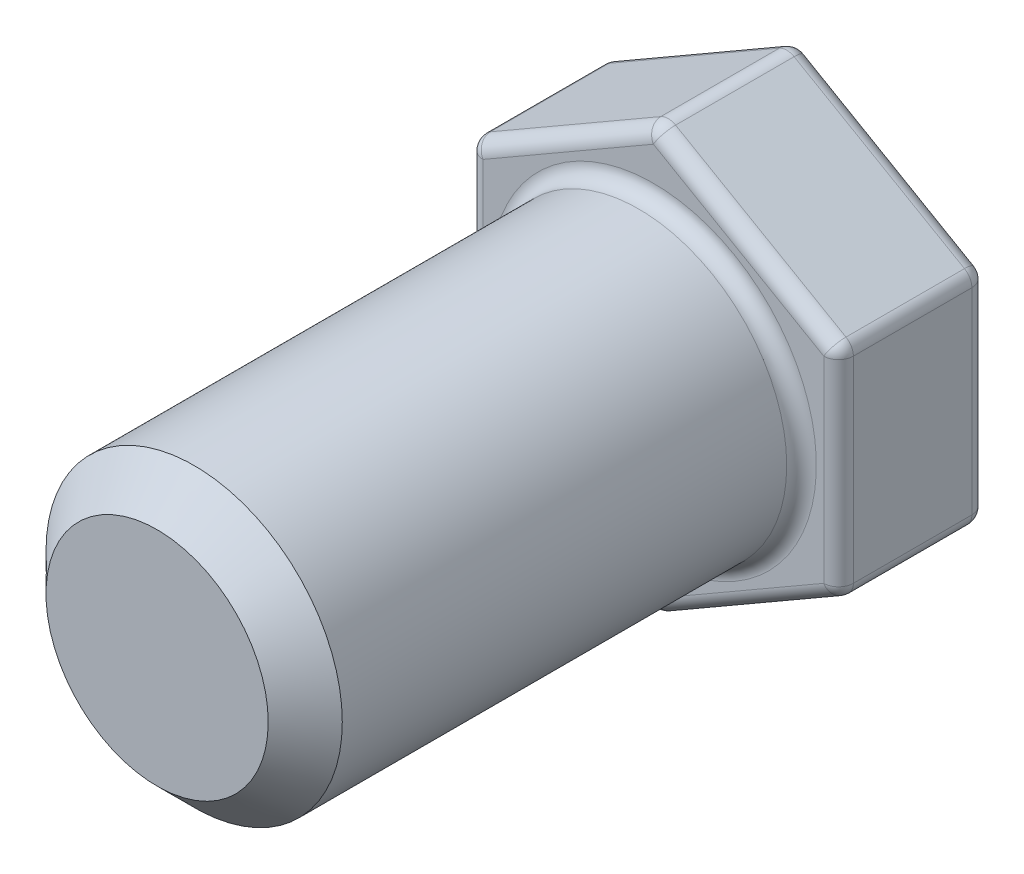
ISO-10303-21;
HEADER;
FILE_DESCRIPTION(('STEP AP214'),'2;1');
FILE_NAME('part.step','',(''),(''),'','','');
FILE_SCHEMA(('AUTOMOTIVE_DESIGN { 1 0 10303 214 1 1 1 1 }'));
ENDSEC;
DATA;
#1=APPLICATION_CONTEXT('core data for automotive mechanical design processes');
#2=APPLICATION_PROTOCOL_DEFINITION('international standard','automotive_design',2000,#1);
#3=PRODUCT_CONTEXT('',#1,'mechanical');
#4=PRODUCT('Part','Part','',(#3));
#5=PRODUCT_RELATED_PRODUCT_CATEGORY('part','',(#4));
#6=PRODUCT_DEFINITION_FORMATION('','',#4);
#7=PRODUCT_DEFINITION_CONTEXT('part definition',#1,'design');
#8=PRODUCT_DEFINITION('design','',#6,#7);
#9=PRODUCT_DEFINITION_SHAPE('','',#8);
#10=(LENGTH_UNIT() NAMED_UNIT(*) SI_UNIT(.MILLI.,.METRE.));
#11=(NAMED_UNIT(*) PLANE_ANGLE_UNIT() SI_UNIT($,.RADIAN.));
#12=(NAMED_UNIT(*) SI_UNIT($,.STERADIAN.) SOLID_ANGLE_UNIT());
#13=UNCERTAINTY_MEASURE_WITH_UNIT(LENGTH_MEASURE(1.E-05),#10,'distance_accuracy_value','');
#14=(GEOMETRIC_REPRESENTATION_CONTEXT(3) GLOBAL_UNCERTAINTY_ASSIGNED_CONTEXT((#13)) GLOBAL_UNIT_ASSIGNED_CONTEXT((#10,
#11,#12)) REPRESENTATION_CONTEXT('',''));
#15=CARTESIAN_POINT('',(0.,0.,0.));
#16=DIRECTION('',(0.,0.,1.));
#17=DIRECTION('',(1.,0.,0.));
#18=AXIS2_PLACEMENT_3D('',#15,#16,#17);
#19=CARTESIAN_POINT('',(0.,0.,6.7));
#20=DIRECTION('',(0.,0.,-1.));
#21=DIRECTION('',(-1.,0.,0.));
#22=AXIS2_PLACEMENT_3D('',#19,#20,#21);
#23=CYLINDRICAL_SURFACE('',#22,2.);
#24=CARTESIAN_POINT('',(0.,0.,6.2));
#25=DIRECTION('',(0.,0.,1.));
#26=DIRECTION('',(1.,0.,0.));
#27=AXIS2_PLACEMENT_3D('',#24,#25,#26);
#28=CIRCLE('',#27,2.);
#29=CARTESIAN_POINT('',(2.,0.,6.2));
#30=VERTEX_POINT('',#29);
#31=EDGE_CURVE('E11',#30,#30,#28,.F.);
#32=ORIENTED_EDGE('',*,*,#31,.T.);
#33=EDGE_LOOP('',(#32));
#34=FACE_BOUND('',#33,.T.);
#35=CARTESIAN_POINT('',(0.,0.,0.2));
#36=DIRECTION('',(0.,0.,-1.));
#37=DIRECTION('',(-1.,0.,0.));
#38=AXIS2_PLACEMENT_3D('',#35,#36,#37);
#39=CIRCLE('',#38,2.);
#40=CARTESIAN_POINT('',(-2.,0.,0.2));
#41=VERTEX_POINT('',#40);
#42=EDGE_CURVE('E265',#41,#41,#39,.F.);
#43=ORIENTED_EDGE('',*,*,#42,.T.);
#44=EDGE_LOOP('',(#43));
#45=FACE_BOUND('',#44,.T.);
#46=ADVANCED_FACE('F40',(#34,#45),#23,.T.);
#47=CARTESIAN_POINT('',(0.,0.,6.7));
#48=DIRECTION('',(0.,0.,1.));
#49=DIRECTION('',(1.,0.,0.));
#50=AXIS2_PLACEMENT_3D('',#47,#48,#49);
#51=PLANE('',#50);
#52=CARTESIAN_POINT('',(0.,0.,6.7));
#53=DIRECTION('',(0.,0.,1.));
#54=DIRECTION('',(1.,0.,0.));
#55=AXIS2_PLACEMENT_3D('',#52,#53,#54);
#56=CIRCLE('',#55,1.5);
#57=CARTESIAN_POINT('',(1.5,0.,6.7));
#58=VERTEX_POINT('',#57);
#59=EDGE_CURVE('E48',#58,#58,#56,.T.);
#60=ORIENTED_EDGE('',*,*,#59,.T.);
#61=EDGE_LOOP('',(#60));
#62=FACE_BOUND('',#61,.T.);
#63=ADVANCED_FACE('F366',(#62),#51,.T.);
#64=CARTESIAN_POINT('',(0.,2.88675134594813,-2.));
#65=DIRECTION('',(-0.500000000000001,-0.866025403784438,0.));
#66=DIRECTION('',(0.866025403784438,-0.500000000000001,0.));
#67=AXIS2_PLACEMENT_3D('',#64,#65,#66);
#68=PLANE('',#67);
#69=DIRECTION('',(0.866025403784438,-0.500000000000001,0.));
#70=VECTOR('',#69,1.);
#71=CARTESIAN_POINT('',(0.,2.88675134594813,-1.8));
#72=LINE('',#71,#70);
#73=CARTESIAN_POINT('',(2.4,1.50111069989303,-1.8));
#74=VERTEX_POINT('',#73);
#75=CARTESIAN_POINT('',(0.100000000000001,2.82901631902917,-1.8));
#76=VERTEX_POINT('',#75);
#77=EDGE_CURVE('E242',#74,#76,#72,.F.);
#78=ORIENTED_EDGE('',*,*,#77,.T.);
#79=DIRECTION('',(0.,0.,1.));
#80=VECTOR('',#79,1.);
#81=CARTESIAN_POINT('',(0.100000000000001,2.82901631902917,-2.));
#82=LINE('',#81,#80);
#83=CARTESIAN_POINT('',(0.100000000000001,2.82901631902917,-0.2));
#84=VERTEX_POINT('',#83);
#85=EDGE_CURVE('E313',#76,#84,#82,.T.);
#86=ORIENTED_EDGE('',*,*,#85,.T.);
#87=DIRECTION('',(0.866025403784438,-0.500000000000001,0.));
#88=VECTOR('',#87,1.);
#89=CARTESIAN_POINT('',(0.,2.88675134594813,-0.2));
#90=LINE('',#89,#88);
#91=CARTESIAN_POINT('',(2.4,1.50111069989303,-0.2));
#92=VERTEX_POINT('',#91);
#93=EDGE_CURVE('E239',#84,#92,#90,.T.);
#94=ORIENTED_EDGE('',*,*,#93,.T.);
#95=DIRECTION('',(0.,0.,1.));
#96=VECTOR('',#95,1.);
#97=CARTESIAN_POINT('',(2.4,1.50111069989303,-2.));
#98=LINE('',#97,#96);
#99=EDGE_CURVE('E311',#92,#74,#98,.F.);
#100=ORIENTED_EDGE('',*,*,#99,.T.);
#101=EDGE_LOOP('',(#78,#86,#94,#100));
#102=FACE_BOUND('',#101,.T.);
#103=ADVANCED_FACE('F384',(#102),#68,.F.);
#104=CARTESIAN_POINT('',(2.5,1.44337567297406,-2.));
#105=DIRECTION('',(-1.,0.,0.));
#106=DIRECTION('',(0.,0.,1.));
#107=AXIS2_PLACEMENT_3D('',#104,#105,#106);
#108=PLANE('',#107);
#109=DIRECTION('',(0.,-1.,0.));
#110=VECTOR('',#109,1.);
#111=CARTESIAN_POINT('',(2.5,1.44337567297406,-0.2));
#112=LINE('',#111,#110);
#113=CARTESIAN_POINT('',(2.5,1.32790561913614,-0.2));
#114=VERTEX_POINT('',#113);
#115=CARTESIAN_POINT('',(2.5,-1.32790561913614,-0.2));
#116=VERTEX_POINT('',#115);
#117=EDGE_CURVE('E235',#114,#116,#112,.T.);
#118=ORIENTED_EDGE('',*,*,#117,.T.);
#119=DIRECTION('',(0.,0.,1.));
#120=VECTOR('',#119,1.);
#121=CARTESIAN_POINT('',(2.5,-1.32790561913614,-2.));
#122=LINE('',#121,#120);
#123=CARTESIAN_POINT('',(2.5,-1.32790561913614,-1.8));
#124=VERTEX_POINT('',#123);
#125=EDGE_CURVE('E332',#116,#124,#122,.F.);
#126=ORIENTED_EDGE('',*,*,#125,.T.);
#127=DIRECTION('',(0.,-1.,0.));
#128=VECTOR('',#127,1.);
#129=CARTESIAN_POINT('',(2.5,1.44337567297406,-1.8));
#130=LINE('',#129,#128);
#131=CARTESIAN_POINT('',(2.5,1.32790561913614,-1.8));
#132=VERTEX_POINT('',#131);
#133=EDGE_CURVE('E237',#124,#132,#130,.F.);
#134=ORIENTED_EDGE('',*,*,#133,.T.);
#135=DIRECTION('',(0.,0.,1.));
#136=VECTOR('',#135,1.);
#137=CARTESIAN_POINT('',(2.5,1.32790561913614,-2.));
#138=LINE('',#137,#136);
#139=EDGE_CURVE('E62',#132,#114,#138,.T.);
#140=ORIENTED_EDGE('',*,*,#139,.T.);
#141=EDGE_LOOP('',(#118,#126,#134,#140));
#142=FACE_BOUND('',#141,.T.);
#143=ADVANCED_FACE('F550',(#142),#108,.F.);
#144=CARTESIAN_POINT('',(2.5,-1.44337567297406,-2.));
#145=DIRECTION('',(-0.5,0.866025403784439,0.));
#146=DIRECTION('',(-0.866025403784439,-0.5,0.));
#147=AXIS2_PLACEMENT_3D('',#144,#145,#146);
#148=PLANE('',#147);
#149=DIRECTION('',(-0.866025403784439,-0.5,0.));
#150=VECTOR('',#149,1.);
#151=CARTESIAN_POINT('',(2.5,-1.44337567297406,-0.2));
#152=LINE('',#151,#150);
#153=CARTESIAN_POINT('',(2.4,-1.50111069989303,-0.2));
#154=VERTEX_POINT('',#153);
#155=CARTESIAN_POINT('',(0.099999999999999,-2.82901631902917,-0.2));
#156=VERTEX_POINT('',#155);
#157=EDGE_CURVE('E229',#154,#156,#152,.T.);
#158=ORIENTED_EDGE('',*,*,#157,.T.);
#159=DIRECTION('',(0.,0.,1.));
#160=VECTOR('',#159,1.);
#161=CARTESIAN_POINT('',(0.1,-2.82901631902917,-2.));
#162=LINE('',#161,#160);
#163=CARTESIAN_POINT('',(0.099999999999999,-2.82901631902917,-1.8));
#164=VERTEX_POINT('',#163);
#165=EDGE_CURVE('E329',#156,#164,#162,.F.);
#166=ORIENTED_EDGE('',*,*,#165,.T.);
#167=DIRECTION('',(-0.866025403784439,-0.5,0.));
#168=VECTOR('',#167,1.);
#169=CARTESIAN_POINT('',(2.5,-1.44337567297406,-1.8));
#170=LINE('',#169,#168);
#171=CARTESIAN_POINT('',(2.4,-1.50111069989303,-1.8));
#172=VERTEX_POINT('',#171);
#173=EDGE_CURVE('E232',#164,#172,#170,.F.);
#174=ORIENTED_EDGE('',*,*,#173,.T.);
#175=DIRECTION('',(0.,0.,1.));
#176=VECTOR('',#175,1.);
#177=CARTESIAN_POINT('',(2.4,-1.50111069989303,-2.));
#178=LINE('',#177,#176);
#179=EDGE_CURVE('E327',#172,#154,#178,.T.);
#180=ORIENTED_EDGE('',*,*,#179,.T.);
#181=EDGE_LOOP('',(#158,#166,#174,#180));
#182=FACE_BOUND('',#181,.T.);
#183=ADVANCED_FACE('F546',(#182),#148,.F.);
#184=CARTESIAN_POINT('',(0.,-2.88675134594813,-2.));
#185=DIRECTION('',(0.5,0.866025403784438,0.));
#186=DIRECTION('',(-0.866025403784438,0.5,0.));
#187=AXIS2_PLACEMENT_3D('',#184,#185,#186);
#188=PLANE('',#187);
#189=DIRECTION('',(-0.866025403784438,0.5,0.));
#190=VECTOR('',#189,1.);
#191=CARTESIAN_POINT('',(0.,-2.88675134594813,-0.2));
#192=LINE('',#191,#190);
#193=CARTESIAN_POINT('',(-0.0999999999999999,-2.82901631902917,-0.2));
#194=VERTEX_POINT('',#193);
#195=CARTESIAN_POINT('',(-2.4,-1.50111069989303,-0.2));
#196=VERTEX_POINT('',#195);
#197=EDGE_CURVE('E223',#194,#196,#192,.T.);
#198=ORIENTED_EDGE('',*,*,#197,.T.);
#199=DIRECTION('',(0.,0.,1.));
#200=VECTOR('',#199,1.);
#201=CARTESIAN_POINT('',(-2.4,-1.50111069989303,-2.));
#202=LINE('',#201,#200);
#203=CARTESIAN_POINT('',(-2.4,-1.50111069989303,-1.8));
#204=VERTEX_POINT('',#203);
#205=EDGE_CURVE('E325',#196,#204,#202,.F.);
#206=ORIENTED_EDGE('',*,*,#205,.T.);
#207=DIRECTION('',(-0.866025403784438,0.5,0.));
#208=VECTOR('',#207,1.);
#209=CARTESIAN_POINT('',(0.,-2.88675134594813,-1.8));
#210=LINE('',#209,#208);
#211=CARTESIAN_POINT('',(-0.0999999999999998,-2.82901631902917,-1.8));
#212=VERTEX_POINT('',#211);
#213=EDGE_CURVE('E226',#204,#212,#210,.F.);
#214=ORIENTED_EDGE('',*,*,#213,.T.);
#215=DIRECTION('',(0.,0.,1.));
#216=VECTOR('',#215,1.);
#217=CARTESIAN_POINT('',(-0.0999999999999999,-2.82901631902917,-2.));
#218=LINE('',#217,#216);
#219=EDGE_CURVE('E323',#212,#194,#218,.T.);
#220=ORIENTED_EDGE('',*,*,#219,.T.);
#221=EDGE_LOOP('',(#198,#206,#214,#220));
#222=FACE_BOUND('',#221,.T.);
#223=ADVANCED_FACE('F540',(#222),#188,.F.);
#224=CARTESIAN_POINT('',(-2.5,-1.44337567297406,-2.));
#225=DIRECTION('',(1.,0.,0.));
#226=DIRECTION('',(0.,1.,0.));
#227=AXIS2_PLACEMENT_3D('',#224,#225,#226);
#228=PLANE('',#227);
#229=DIRECTION('',(0.,1.,0.));
#230=VECTOR('',#229,1.);
#231=CARTESIAN_POINT('',(-2.5,-1.44337567297406,-0.2));
#232=LINE('',#231,#230);
#233=CARTESIAN_POINT('',(-2.5,-1.32790561913614,-0.2));
#234=VERTEX_POINT('',#233);
#235=CARTESIAN_POINT('',(-2.5,1.32790561913614,-0.2));
#236=VERTEX_POINT('',#235);
#237=EDGE_CURVE('E217',#234,#236,#232,.T.);
#238=ORIENTED_EDGE('',*,*,#237,.T.);
#239=DIRECTION('',(0.,0.,1.));
#240=VECTOR('',#239,1.);
#241=CARTESIAN_POINT('',(-2.5,1.32790561913614,-2.));
#242=LINE('',#241,#240);
#243=CARTESIAN_POINT('',(-2.5,1.32790561913614,-1.8));
#244=VERTEX_POINT('',#243);
#245=EDGE_CURVE('E321',#236,#244,#242,.F.);
#246=ORIENTED_EDGE('',*,*,#245,.T.);
#247=DIRECTION('',(0.,1.,0.));
#248=VECTOR('',#247,1.);
#249=CARTESIAN_POINT('',(-2.5,-1.44337567297406,-1.8));
#250=LINE('',#249,#248);
#251=CARTESIAN_POINT('',(-2.5,-1.32790561913614,-1.8));
#252=VERTEX_POINT('',#251);
#253=EDGE_CURVE('E220',#244,#252,#250,.F.);
#254=ORIENTED_EDGE('',*,*,#253,.T.);
#255=DIRECTION('',(0.,0.,1.));
#256=VECTOR('',#255,1.);
#257=CARTESIAN_POINT('',(-2.5,-1.32790561913614,-2.));
#258=LINE('',#257,#256);
#259=EDGE_CURVE('E319',#252,#234,#258,.T.);
#260=ORIENTED_EDGE('',*,*,#259,.T.);
#261=EDGE_LOOP('',(#238,#246,#254,#260));
#262=FACE_BOUND('',#261,.T.);
#263=ADVANCED_FACE('F527',(#262),#228,.F.);
#264=CARTESIAN_POINT('',(-2.5,1.44337567297407,-2.));
#265=DIRECTION('',(0.5,-0.866025403784439,0.));
#266=DIRECTION('',(0.866025403784439,0.5,0.));
#267=AXIS2_PLACEMENT_3D('',#264,#265,#266);
#268=PLANE('',#267);
#269=DIRECTION('',(0.866025403784439,0.5,0.));
#270=VECTOR('',#269,1.);
#271=CARTESIAN_POINT('',(-2.5,1.44337567297407,-0.2));
#272=LINE('',#271,#270);
#273=CARTESIAN_POINT('',(-2.4,1.50111069989303,-0.2));
#274=VERTEX_POINT('',#273);
#275=CARTESIAN_POINT('',(-0.099999999999999,2.82901631902917,-0.2));
#276=VERTEX_POINT('',#275);
#277=EDGE_CURVE('E208',#274,#276,#272,.T.);
#278=ORIENTED_EDGE('',*,*,#277,.T.);
#279=DIRECTION('',(0.,0.,1.));
#280=VECTOR('',#279,1.);
#281=CARTESIAN_POINT('',(-0.0999999999999994,2.82901631902917,-2.));
#282=LINE('',#281,#280);
#283=CARTESIAN_POINT('',(-0.0999999999999985,2.82901631902917,-1.8));
#284=VERTEX_POINT('',#283);
#285=EDGE_CURVE('E317',#276,#284,#282,.F.);
#286=ORIENTED_EDGE('',*,*,#285,.T.);
#287=DIRECTION('',(0.866025403784439,0.5,0.));
#288=VECTOR('',#287,1.);
#289=CARTESIAN_POINT('',(-2.5,1.44337567297407,-1.8));
#290=LINE('',#289,#288);
#291=CARTESIAN_POINT('',(-2.4,1.50111069989303,-1.8));
#292=VERTEX_POINT('',#291);
#293=EDGE_CURVE('E189',#284,#292,#290,.F.);
#294=ORIENTED_EDGE('',*,*,#293,.T.);
#295=DIRECTION('',(0.,0.,1.));
#296=VECTOR('',#295,1.);
#297=CARTESIAN_POINT('',(-2.4,1.50111069989303,-2.));
#298=LINE('',#297,#296);
#299=EDGE_CURVE('E315',#292,#274,#298,.T.);
#300=ORIENTED_EDGE('',*,*,#299,.T.);
#301=EDGE_LOOP('',(#278,#286,#294,#300));
#302=FACE_BOUND('',#301,.T.);
#303=ADVANCED_FACE('F532',(#302),#268,.F.);
#304=CARTESIAN_POINT('',(0.,0.,-2.));
#305=DIRECTION('',(0.,0.,-1.));
#306=DIRECTION('',(-1.,0.,0.));
#307=AXIS2_PLACEMENT_3D('',#304,#305,#306);
#308=PLANE('',#307);
#309=DIRECTION('',(0.,1.,0.));
#310=VECTOR('',#309,1.);
#311=CARTESIAN_POINT('',(-2.3,1.44337567297407,-2.));
#312=LINE('',#311,#310);
#313=CARTESIAN_POINT('',(-2.3,-1.32790561913614,-2.));
#314=VERTEX_POINT('',#313);
#315=CARTESIAN_POINT('',(-2.3,1.32790561913614,-2.));
#316=VERTEX_POINT('',#315);
#317=EDGE_CURVE('E207',#314,#316,#312,.T.);
#318=ORIENTED_EDGE('',*,*,#317,.T.);
#319=DIRECTION('',(0.866025403784439,0.5,0.));
#320=VECTOR('',#319,1.);
#321=CARTESIAN_POINT('',(0.100000000000001,2.71354626519124,-2.));
#322=LINE('',#321,#320);
#323=CARTESIAN_POINT('',(0.,2.65581123827228,-2.));
#324=VERTEX_POINT('',#323);
#325=EDGE_CURVE('E186',#316,#324,#322,.T.);
#326=ORIENTED_EDGE('',*,*,#325,.T.);
#327=DIRECTION('',(0.866025403784438,-0.500000000000001,0.));
#328=VECTOR('',#327,1.);
#329=CARTESIAN_POINT('',(2.4,1.27017059221718,-2.));
#330=LINE('',#329,#328);
#331=CARTESIAN_POINT('',(2.3,1.32790561913614,-2.));
#332=VERTEX_POINT('',#331);
#333=EDGE_CURVE('E194',#324,#332,#330,.T.);
#334=ORIENTED_EDGE('',*,*,#333,.T.);
#335=DIRECTION('',(0.,-1.,0.));
#336=VECTOR('',#335,1.);
#337=CARTESIAN_POINT('',(2.3,-1.44337567297406,-2.));
#338=LINE('',#337,#336);
#339=CARTESIAN_POINT('',(2.3,-1.32790561913614,-2.));
#340=VERTEX_POINT('',#339);
#341=EDGE_CURVE('E200',#332,#340,#338,.T.);
#342=ORIENTED_EDGE('',*,*,#341,.T.);
#343=DIRECTION('',(-0.866025403784439,-0.5,0.));
#344=VECTOR('',#343,1.);
#345=CARTESIAN_POINT('',(-0.1,-2.71354626519124,-2.));
#346=LINE('',#345,#344);
#347=CARTESIAN_POINT('',(0.,-2.65581123827228,-2.));
#348=VERTEX_POINT('',#347);
#349=EDGE_CURVE('E832',#340,#348,#346,.T.);
#350=ORIENTED_EDGE('',*,*,#349,.T.);
#351=DIRECTION('',(-0.866025403784438,0.5,0.));
#352=VECTOR('',#351,1.);
#353=CARTESIAN_POINT('',(-2.4,-1.27017059221718,-2.));
#354=LINE('',#353,#352);
#355=EDGE_CURVE('E212',#348,#314,#354,.T.);
#356=ORIENTED_EDGE('',*,*,#355,.T.);
#357=EDGE_LOOP('',(#318,#326,#334,#342,#350,#356));
#358=FACE_BOUND('',#357,.T.);
#359=ADVANCED_FACE('F204',(#358),#308,.T.);
#360=CARTESIAN_POINT('',(0.,0.,0.));
#361=DIRECTION('',(0.,0.,-1.));
#362=DIRECTION('',(-1.,0.,0.));
#363=AXIS2_PLACEMENT_3D('',#360,#361,#362);
#364=PLANE('',#363);
#365=DIRECTION('',(-0.866025403784439,-0.5,0.));
#366=VECTOR('',#365,1.);
#367=CARTESIAN_POINT('',(1.15,-1.99185842870421,0.));
#368=LINE('',#367,#366);
#369=CARTESIAN_POINT('',(0.,-2.65581123827228,0.));
#370=VERTEX_POINT('',#369);
#371=CARTESIAN_POINT('',(2.3,-1.32790561913614,0.));
#372=VERTEX_POINT('',#371);
#373=EDGE_CURVE('E259',#370,#372,#368,.F.);
#374=ORIENTED_EDGE('',*,*,#373,.T.);
#375=DIRECTION('',(0.,-1.,0.));
#376=VECTOR('',#375,1.);
#377=CARTESIAN_POINT('',(2.3,0.,0.));
#378=LINE('',#377,#376);
#379=CARTESIAN_POINT('',(2.3,1.32790561913614,0.));
#380=VERTEX_POINT('',#379);
#381=EDGE_CURVE('E262',#372,#380,#378,.F.);
#382=ORIENTED_EDGE('',*,*,#381,.T.);
#383=DIRECTION('',(0.866025403784438,-0.500000000000001,0.));
#384=VECTOR('',#383,1.);
#385=CARTESIAN_POINT('',(1.15,1.99185842870421,0.));
#386=LINE('',#385,#384);
#387=CARTESIAN_POINT('',(0.,2.65581123827228,0.));
#388=VERTEX_POINT('',#387);
#389=EDGE_CURVE('E247',#380,#388,#386,.F.);
#390=ORIENTED_EDGE('',*,*,#389,.T.);
#391=DIRECTION('',(0.866025403784439,0.5,0.));
#392=VECTOR('',#391,1.);
#393=CARTESIAN_POINT('',(-1.15,1.99185842870421,0.));
#394=LINE('',#393,#392);
#395=CARTESIAN_POINT('',(-2.3,1.32790561913614,0.));
#396=VERTEX_POINT('',#395);
#397=EDGE_CURVE('E250',#388,#396,#394,.F.);
#398=ORIENTED_EDGE('',*,*,#397,.T.);
#399=DIRECTION('',(0.,1.,0.));
#400=VECTOR('',#399,1.);
#401=CARTESIAN_POINT('',(-2.3,0.,0.));
#402=LINE('',#401,#400);
#403=CARTESIAN_POINT('',(-2.3,-1.32790561913614,0.));
#404=VERTEX_POINT('',#403);
#405=EDGE_CURVE('E253',#396,#404,#402,.F.);
#406=ORIENTED_EDGE('',*,*,#405,.T.);
#407=DIRECTION('',(-0.866025403784438,0.5,0.));
#408=VECTOR('',#407,1.);
#409=CARTESIAN_POINT('',(-1.15,-1.99185842870421,0.));
#410=LINE('',#409,#408);
#411=EDGE_CURVE('E256',#404,#370,#410,.F.);
#412=ORIENTED_EDGE('',*,*,#411,.T.);
#413=EDGE_LOOP('',(#374,#382,#390,#398,#406,#412));
#414=FACE_BOUND('',#413,.T.);
#415=CARTESIAN_POINT('',(0.,0.,0.));
#416=DIRECTION('',(0.,0.,-1.));
#417=DIRECTION('',(-1.,0.,0.));
#418=AXIS2_PLACEMENT_3D('',#415,#416,#417);
#419=CIRCLE('',#418,2.2);
#420=CARTESIAN_POINT('',(-2.2,0.,0.));
#421=VERTEX_POINT('',#420);
#422=EDGE_CURVE('E244',#421,#421,#419,.T.);
#423=ORIENTED_EDGE('',*,*,#422,.T.);
#424=EDGE_LOOP('',(#423));
#425=FACE_BOUND('',#424,.T.);
#426=ADVANCED_FACE('F409',(#414,#425),#364,.F.);
#427=CARTESIAN_POINT('',(1.15,-1.99185842870421,-1.8));
#428=DIRECTION('',(0.866025403784439,0.5,0.));
#429=DIRECTION('',(-0.5,0.866025403784439,0.));
#430=AXIS2_PLACEMENT_3D('',#427,#428,#429);
#431=CYLINDRICAL_SURFACE('',#430,0.2);
#432=ORIENTED_EDGE('',*,*,#173,.F.);
#433=CARTESIAN_POINT('',(0.,-2.65581123827228,-1.8));
#434=DIRECTION('',(0.866025403784439,0.5,0.));
#435=DIRECTION('',(-0.5,0.866025403784439,0.));
#436=AXIS2_PLACEMENT_3D('',#433,#434,#435);
#437=CIRCLE('',#436,0.2);
#438=EDGE_CURVE('E297',#164,#348,#437,.T.);
#439=ORIENTED_EDGE('',*,*,#438,.T.);
#440=ORIENTED_EDGE('',*,*,#349,.F.);
#441=CARTESIAN_POINT('',(2.3,-1.32790561913614,-1.8));
#442=DIRECTION('',(0.866025403784439,0.5,0.));
#443=DIRECTION('',(-0.5,0.866025403784439,0.));
#444=AXIS2_PLACEMENT_3D('',#441,#442,#443);
#445=CIRCLE('',#444,0.2);
#446=EDGE_CURVE('E295',#340,#172,#445,.F.);
#447=ORIENTED_EDGE('',*,*,#446,.T.);
#448=EDGE_LOOP('',(#432,#439,#440,#447));
#449=FACE_BOUND('',#448,.T.);
#450=ADVANCED_FACE('F405',(#449),#431,.T.);
#451=CARTESIAN_POINT('',(-1.15,-1.99185842870421,-1.8));
#452=DIRECTION('',(0.866025403784438,-0.5,0.));
#453=DIRECTION('',(0.5,0.866025403784438,0.));
#454=AXIS2_PLACEMENT_3D('',#451,#452,#453);
#455=CYLINDRICAL_SURFACE('',#454,0.2);
#456=ORIENTED_EDGE('',*,*,#213,.F.);
#457=CARTESIAN_POINT('',(-2.3,-1.32790561913614,-1.8));
#458=DIRECTION('',(0.866025403784438,-0.5,0.));
#459=DIRECTION('',(0.5,0.866025403784438,0.));
#460=AXIS2_PLACEMENT_3D('',#457,#458,#459);
#461=CIRCLE('',#460,0.2);
#462=EDGE_CURVE('E289',#204,#314,#461,.T.);
#463=ORIENTED_EDGE('',*,*,#462,.T.);
#464=ORIENTED_EDGE('',*,*,#355,.F.);
#465=CARTESIAN_POINT('',(0.,-2.65581123827228,-1.8));
#466=DIRECTION('',(0.866025403784438,-0.5,0.));
#467=DIRECTION('',(0.5,0.866025403784438,0.));
#468=AXIS2_PLACEMENT_3D('',#465,#466,#467);
#469=CIRCLE('',#468,0.2);
#470=EDGE_CURVE('E286',#348,#212,#469,.F.);
#471=ORIENTED_EDGE('',*,*,#470,.T.);
#472=EDGE_LOOP('',(#456,#463,#464,#471));
#473=FACE_BOUND('',#472,.T.);
#474=ADVANCED_FACE('F401',(#473),#455,.T.);
#475=CARTESIAN_POINT('',(2.3,0.,-1.8));
#476=DIRECTION('',(0.,1.,0.));
#477=DIRECTION('',(0.,0.,1.));
#478=AXIS2_PLACEMENT_3D('',#475,#476,#477);
#479=CYLINDRICAL_SURFACE('',#478,0.2);
#480=ORIENTED_EDGE('',*,*,#133,.F.);
#481=CARTESIAN_POINT('',(2.3,-1.32790561913614,-1.8));
#482=DIRECTION('',(0.,1.,0.));
#483=DIRECTION('',(0.,0.,1.));
#484=AXIS2_PLACEMENT_3D('',#481,#482,#483);
#485=CIRCLE('',#484,0.2);
#486=EDGE_CURVE('E305',#124,#340,#485,.T.);
#487=ORIENTED_EDGE('',*,*,#486,.T.);
#488=ORIENTED_EDGE('',*,*,#341,.F.);
#489=CARTESIAN_POINT('',(2.3,1.32790561913614,-1.8));
#490=DIRECTION('',(0.,1.,0.));
#491=DIRECTION('',(0.,0.,1.));
#492=AXIS2_PLACEMENT_3D('',#489,#490,#491);
#493=CIRCLE('',#492,0.2);
#494=EDGE_CURVE('E303',#332,#132,#493,.F.);
#495=ORIENTED_EDGE('',*,*,#494,.T.);
#496=EDGE_LOOP('',(#480,#487,#488,#495));
#497=FACE_BOUND('',#496,.T.);
#498=ADVANCED_FACE('F397',(#497),#479,.T.);
#499=CARTESIAN_POINT('',(-2.3,0.,-1.8));
#500=DIRECTION('',(0.,-1.,0.));
#501=DIRECTION('',(1.,0.,0.));
#502=AXIS2_PLACEMENT_3D('',#499,#500,#501);
#503=CYLINDRICAL_SURFACE('',#502,0.2);
#504=ORIENTED_EDGE('',*,*,#253,.F.);
#505=CARTESIAN_POINT('',(-2.3,1.32790561913614,-1.8));
#506=DIRECTION('',(0.,-1.,0.));
#507=DIRECTION('',(1.,0.,0.));
#508=AXIS2_PLACEMENT_3D('',#505,#506,#507);
#509=CIRCLE('',#508,0.2);
#510=EDGE_CURVE('E280',#244,#316,#509,.T.);
#511=ORIENTED_EDGE('',*,*,#510,.T.);
#512=ORIENTED_EDGE('',*,*,#317,.F.);
#513=CARTESIAN_POINT('',(-2.3,-1.32790561913614,-1.8));
#514=DIRECTION('',(0.,-1.,0.));
#515=DIRECTION('',(1.,0.,0.));
#516=AXIS2_PLACEMENT_3D('',#513,#514,#515);
#517=CIRCLE('',#516,0.2);
#518=EDGE_CURVE('E277',#314,#252,#517,.F.);
#519=ORIENTED_EDGE('',*,*,#518,.T.);
#520=EDGE_LOOP('',(#504,#511,#512,#519));
#521=FACE_BOUND('',#520,.T.);
#522=ADVANCED_FACE('F394',(#521),#503,.T.);
#523=CARTESIAN_POINT('',(1.15,1.99185842870421,-1.8));
#524=DIRECTION('',(-0.866025403784438,0.500000000000001,0.));
#525=DIRECTION('',(-0.500000000000001,-0.866025403784438,0.));
#526=AXIS2_PLACEMENT_3D('',#523,#524,#525);
#527=CYLINDRICAL_SURFACE('',#526,0.2);
#528=ORIENTED_EDGE('',*,*,#333,.F.);
#529=CARTESIAN_POINT('',(0.,2.65581123827228,-1.8));
#530=DIRECTION('',(-0.866025403784438,0.500000000000001,0.));
#531=DIRECTION('',(-0.500000000000001,-0.866025403784438,0.));
#532=AXIS2_PLACEMENT_3D('',#529,#530,#531);
#533=CIRCLE('',#532,0.2);
#534=EDGE_CURVE('E167',#324,#76,#533,.F.);
#535=ORIENTED_EDGE('',*,*,#534,.T.);
#536=ORIENTED_EDGE('',*,*,#77,.F.);
#537=CARTESIAN_POINT('',(2.3,1.32790561913614,-1.8));
#538=DIRECTION('',(-0.866025403784438,0.500000000000001,0.));
#539=DIRECTION('',(-0.500000000000001,-0.866025403784438,0.));
#540=AXIS2_PLACEMENT_3D('',#537,#538,#539);
#541=CIRCLE('',#540,0.2);
#542=EDGE_CURVE('E178',#74,#332,#541,.T.);
#543=ORIENTED_EDGE('',*,*,#542,.T.);
#544=EDGE_LOOP('',(#528,#535,#536,#543));
#545=FACE_BOUND('',#544,.T.);
#546=ADVANCED_FACE('F195',(#545),#527,.T.);
#547=CARTESIAN_POINT('',(-1.15,1.99185842870421,-1.8));
#548=DIRECTION('',(-0.866025403784439,-0.5,0.));
#549=DIRECTION('',(0.5,-0.866025403784439,0.));
#550=AXIS2_PLACEMENT_3D('',#547,#548,#549);
#551=CYLINDRICAL_SURFACE('',#550,0.2);
#552=ORIENTED_EDGE('',*,*,#293,.F.);
#553=CARTESIAN_POINT('',(0.,2.65581123827228,-1.8));
#554=DIRECTION('',(-0.866025403784439,-0.5,0.));
#555=DIRECTION('',(0.5,-0.866025403784439,0.));
#556=AXIS2_PLACEMENT_3D('',#553,#554,#555);
#557=CIRCLE('',#556,0.2);
#558=EDGE_CURVE('E170',#284,#324,#557,.T.);
#559=ORIENTED_EDGE('',*,*,#558,.T.);
#560=ORIENTED_EDGE('',*,*,#325,.F.);
#561=CARTESIAN_POINT('',(-2.3,1.32790561913614,-1.8));
#562=DIRECTION('',(-0.866025403784439,-0.5,0.));
#563=DIRECTION('',(0.5,-0.866025403784439,0.));
#564=AXIS2_PLACEMENT_3D('',#561,#562,#563);
#565=CIRCLE('',#564,0.2);
#566=EDGE_CURVE('E190',#316,#292,#565,.F.);
#567=ORIENTED_EDGE('',*,*,#566,.T.);
#568=EDGE_LOOP('',(#552,#559,#560,#567));
#569=FACE_BOUND('',#568,.T.);
#570=ADVANCED_FACE('F183',(#569),#551,.T.);
#571=CARTESIAN_POINT('',(-2.3,-1.44337567297406,-0.2));
#572=DIRECTION('',(0.,1.,0.));
#573=DIRECTION('',(-1.,0.,0.));
#574=AXIS2_PLACEMENT_3D('',#571,#572,#573);
#575=CYLINDRICAL_SURFACE('',#574,0.2);
#576=ORIENTED_EDGE('',*,*,#405,.F.);
#577=CARTESIAN_POINT('',(-2.3,1.32790561913614,-0.2));
#578=DIRECTION('',(0.,1.,0.));
#579=DIRECTION('',(-1.,0.,0.));
#580=AXIS2_PLACEMENT_3D('',#577,#578,#579);
#581=CIRCLE('',#580,0.2);
#582=EDGE_CURVE('E284',#396,#236,#581,.F.);
#583=ORIENTED_EDGE('',*,*,#582,.T.);
#584=ORIENTED_EDGE('',*,*,#237,.F.);
#585=CARTESIAN_POINT('',(-2.3,-1.32790561913614,-0.2));
#586=DIRECTION('',(0.,1.,0.));
#587=DIRECTION('',(-1.,0.,0.));
#588=AXIS2_PLACEMENT_3D('',#585,#586,#587);
#589=CIRCLE('',#588,0.2);
#590=EDGE_CURVE('E282',#234,#404,#589,.T.);
#591=ORIENTED_EDGE('',*,*,#590,.T.);
#592=EDGE_LOOP('',(#576,#583,#584,#591));
#593=FACE_BOUND('',#592,.T.);
#594=ADVANCED_FACE('F391',(#593),#575,.T.);
#595=CARTESIAN_POINT('',(-2.4,1.27017059221718,-0.2));
#596=DIRECTION('',(0.866025403784439,0.5,0.));
#597=DIRECTION('',(-0.5,0.866025403784439,0.));
#598=AXIS2_PLACEMENT_3D('',#595,#596,#597);
#599=CYLINDRICAL_SURFACE('',#598,0.2);
#600=ORIENTED_EDGE('',*,*,#397,.F.);
#601=CARTESIAN_POINT('',(0.,2.65581123827228,-0.2));
#602=DIRECTION('',(0.866025403784439,0.5,0.));
#603=DIRECTION('',(-0.5,0.866025403784439,0.));
#604=AXIS2_PLACEMENT_3D('',#601,#602,#603);
#605=CIRCLE('',#604,0.2);
#606=EDGE_CURVE('E275',#388,#276,#605,.F.);
#607=ORIENTED_EDGE('',*,*,#606,.T.);
#608=ORIENTED_EDGE('',*,*,#277,.F.);
#609=CARTESIAN_POINT('',(-2.3,1.32790561913614,-0.2));
#610=DIRECTION('',(0.866025403784439,0.5,0.));
#611=DIRECTION('',(-0.5,0.866025403784439,0.));
#612=AXIS2_PLACEMENT_3D('',#609,#610,#611);
#613=CIRCLE('',#612,0.2);
#614=EDGE_CURVE('E273',#274,#396,#613,.T.);
#615=ORIENTED_EDGE('',*,*,#614,.T.);
#616=EDGE_LOOP('',(#600,#607,#608,#615));
#617=FACE_BOUND('',#616,.T.);
#618=ADVANCED_FACE('F426',(#617),#599,.T.);
#619=CARTESIAN_POINT('',(0.1,-2.71354626519124,-0.2));
#620=DIRECTION('',(-0.866025403784438,0.5,0.));
#621=DIRECTION('',(-0.5,-0.866025403784438,0.));
#622=AXIS2_PLACEMENT_3D('',#619,#620,#621);
#623=CYLINDRICAL_SURFACE('',#622,0.2);
#624=ORIENTED_EDGE('',*,*,#411,.F.);
#625=CARTESIAN_POINT('',(-2.3,-1.32790561913614,-0.2));
#626=DIRECTION('',(-0.866025403784438,0.5,0.));
#627=DIRECTION('',(-0.5,-0.866025403784438,0.));
#628=AXIS2_PLACEMENT_3D('',#625,#626,#627);
#629=CIRCLE('',#628,0.2);
#630=EDGE_CURVE('E293',#404,#196,#629,.F.);
#631=ORIENTED_EDGE('',*,*,#630,.T.);
#632=ORIENTED_EDGE('',*,*,#197,.F.);
#633=CARTESIAN_POINT('',(0.,-2.65581123827228,-0.2));
#634=DIRECTION('',(-0.866025403784438,0.5,0.));
#635=DIRECTION('',(-0.5,-0.866025403784438,0.));
#636=AXIS2_PLACEMENT_3D('',#633,#634,#635);
#637=CIRCLE('',#636,0.2);
#638=EDGE_CURVE('E291',#194,#370,#637,.T.);
#639=ORIENTED_EDGE('',*,*,#638,.T.);
#640=EDGE_LOOP('',(#624,#631,#632,#639));
#641=FACE_BOUND('',#640,.T.);
#642=ADVANCED_FACE('F422',(#641),#623,.T.);
#643=CARTESIAN_POINT('',(-0.0999999999999993,2.71354626519124,-0.2));
#644=DIRECTION('',(0.866025403784438,-0.500000000000001,0.));
#645=DIRECTION('',(0.500000000000001,0.866025403784438,0.));
#646=AXIS2_PLACEMENT_3D('',#643,#644,#645);
#647=CYLINDRICAL_SURFACE('',#646,0.2);
#648=ORIENTED_EDGE('',*,*,#93,.F.);
#649=CARTESIAN_POINT('',(0.,2.65581123827228,-0.2));
#650=DIRECTION('',(0.866025403784438,-0.500000000000001,0.));
#651=DIRECTION('',(0.500000000000001,0.866025403784438,0.));
#652=AXIS2_PLACEMENT_3D('',#649,#650,#651);
#653=CIRCLE('',#652,0.2);
#654=EDGE_CURVE('E271',#84,#388,#653,.T.);
#655=ORIENTED_EDGE('',*,*,#654,.T.);
#656=ORIENTED_EDGE('',*,*,#389,.F.);
#657=CARTESIAN_POINT('',(2.3,1.32790561913614,-0.2));
#658=DIRECTION('',(0.866025403784438,-0.500000000000001,0.));
#659=DIRECTION('',(0.500000000000001,0.866025403784438,0.));
#660=AXIS2_PLACEMENT_3D('',#657,#658,#659);
#661=CIRCLE('',#660,0.2);
#662=EDGE_CURVE('E177',#380,#92,#661,.F.);
#663=ORIENTED_EDGE('',*,*,#662,.T.);
#664=EDGE_LOOP('',(#648,#655,#656,#663));
#665=FACE_BOUND('',#664,.T.);
#666=ADVANCED_FACE('F418',(#665),#647,.T.);
#667=CARTESIAN_POINT('',(2.4,-1.27017059221718,-0.2));
#668=DIRECTION('',(-0.866025403784439,-0.5,0.));
#669=DIRECTION('',(0.5,-0.866025403784439,0.));
#670=AXIS2_PLACEMENT_3D('',#667,#668,#669);
#671=CYLINDRICAL_SURFACE('',#670,0.2);
#672=ORIENTED_EDGE('',*,*,#373,.F.);
#673=CARTESIAN_POINT('',(0.,-2.65581123827228,-0.2));
#674=DIRECTION('',(-0.866025403784439,-0.5,0.));
#675=DIRECTION('',(0.5,-0.866025403784439,0.));
#676=AXIS2_PLACEMENT_3D('',#673,#674,#675);
#677=CIRCLE('',#676,0.2);
#678=EDGE_CURVE('E301',#370,#156,#677,.F.);
#679=ORIENTED_EDGE('',*,*,#678,.T.);
#680=ORIENTED_EDGE('',*,*,#157,.F.);
#681=CARTESIAN_POINT('',(2.3,-1.32790561913614,-0.2));
#682=DIRECTION('',(-0.866025403784439,-0.5,0.));
#683=DIRECTION('',(0.5,-0.866025403784439,0.));
#684=AXIS2_PLACEMENT_3D('',#681,#682,#683);
#685=CIRCLE('',#684,0.2);
#686=EDGE_CURVE('E299',#154,#372,#685,.T.);
#687=ORIENTED_EDGE('',*,*,#686,.T.);
#688=EDGE_LOOP('',(#672,#679,#680,#687));
#689=FACE_BOUND('',#688,.T.);
#690=ADVANCED_FACE('F415',(#689),#671,.T.);
#691=CARTESIAN_POINT('',(2.3,1.44337567297406,-0.2));
#692=DIRECTION('',(0.,-1.,0.));
#693=DIRECTION('',(0.,0.,-1.));
#694=AXIS2_PLACEMENT_3D('',#691,#692,#693);
#695=CYLINDRICAL_SURFACE('',#694,0.2);
#696=ORIENTED_EDGE('',*,*,#381,.F.);
#697=CARTESIAN_POINT('',(2.3,-1.32790561913614,-0.2));
#698=DIRECTION('',(0.,-1.,0.));
#699=DIRECTION('',(0.,0.,-1.));
#700=AXIS2_PLACEMENT_3D('',#697,#698,#699);
#701=CIRCLE('',#700,0.2);
#702=EDGE_CURVE('E55',#372,#116,#701,.F.);
#703=ORIENTED_EDGE('',*,*,#702,.T.);
#704=ORIENTED_EDGE('',*,*,#117,.F.);
#705=CARTESIAN_POINT('',(2.3,1.32790561913614,-0.2));
#706=DIRECTION('',(0.,-1.,0.));
#707=DIRECTION('',(0.,0.,-1.));
#708=AXIS2_PLACEMENT_3D('',#705,#706,#707);
#709=CIRCLE('',#708,0.2);
#710=EDGE_CURVE('E308',#114,#380,#709,.T.);
#711=ORIENTED_EDGE('',*,*,#710,.T.);
#712=EDGE_LOOP('',(#696,#703,#704,#711));
#713=FACE_BOUND('',#712,.T.);
#714=ADVANCED_FACE('F411',(#713),#695,.T.);
#715=CARTESIAN_POINT('',(0.,0.,0.2));
#716=DIRECTION('',(0.,0.,-1.));
#717=DIRECTION('',(-1.,0.,0.));
#718=AXIS2_PLACEMENT_3D('',#715,#716,#717);
#719=TOROIDAL_SURFACE('',#718,2.2,0.2);
#720=ORIENTED_EDGE('',*,*,#422,.F.);
#721=EDGE_LOOP('',(#720));
#722=FACE_BOUND('',#721,.T.);
#723=ORIENTED_EDGE('',*,*,#42,.F.);
#724=EDGE_LOOP('',(#723));
#725=FACE_BOUND('',#724,.T.);
#726=ADVANCED_FACE('F414',(#722,#725),#719,.F.);
#727=CARTESIAN_POINT('',(0.,2.65581123827228,-0.2));
#728=DIRECTION('',(0.,0.,1.));
#729=DIRECTION('',(1.,0.,0.));
#730=AXIS2_PLACEMENT_3D('',#727,#728,#729);
#731=SPHERICAL_SURFACE('',#730,0.2);
#732=ORIENTED_EDGE('',*,*,#606,.F.);
#733=ORIENTED_EDGE('',*,*,#654,.F.);
#734=CARTESIAN_POINT('',(0.,2.65581123827228,-0.2));
#735=DIRECTION('',(0.,0.,-1.));
#736=DIRECTION('',(-1.,0.,0.));
#737=AXIS2_PLACEMENT_3D('',#734,#735,#736);
#738=CIRCLE('',#737,0.2);
#739=EDGE_CURVE('E201',#276,#84,#738,.T.);
#740=ORIENTED_EDGE('',*,*,#739,.F.);
#741=EDGE_LOOP('',(#732,#733,#740));
#742=FACE_BOUND('',#741,.T.);
#743=ADVANCED_FACE('F436',(#742),#731,.T.);
#744=CARTESIAN_POINT('',(0.,2.65581123827228,-2.));
#745=DIRECTION('',(0.,0.,1.));
#746=DIRECTION('',(1.,0.,0.));
#747=AXIS2_PLACEMENT_3D('',#744,#745,#746);
#748=CYLINDRICAL_SURFACE('',#747,0.2);
#749=ORIENTED_EDGE('',*,*,#739,.T.);
#750=ORIENTED_EDGE('',*,*,#85,.F.);
#751=CARTESIAN_POINT('',(0.,2.65581123827228,-1.8));
#752=DIRECTION('',(0.,0.,-1.));
#753=DIRECTION('',(-1.,0.,0.));
#754=AXIS2_PLACEMENT_3D('',#751,#752,#753);
#755=CIRCLE('',#754,0.2);
#756=EDGE_CURVE('E172',#284,#76,#755,.T.);
#757=ORIENTED_EDGE('',*,*,#756,.F.);
#758=ORIENTED_EDGE('',*,*,#285,.F.);
#759=EDGE_LOOP('',(#749,#750,#757,#758));
#760=FACE_BOUND('',#759,.T.);
#761=ADVANCED_FACE('F441',(#760),#748,.T.);
#762=CARTESIAN_POINT('',(0.,2.65581123827228,-1.8));
#763=DIRECTION('',(0.,0.,1.));
#764=DIRECTION('',(1.,0.,0.));
#765=AXIS2_PLACEMENT_3D('',#762,#763,#764);
#766=SPHERICAL_SURFACE('',#765,0.2);
#767=ORIENTED_EDGE('',*,*,#756,.T.);
#768=ORIENTED_EDGE('',*,*,#534,.F.);
#769=ORIENTED_EDGE('',*,*,#558,.F.);
#770=EDGE_LOOP('',(#767,#768,#769));
#771=FACE_BOUND('',#770,.T.);
#772=ADVANCED_FACE('F169',(#771),#766,.T.);
#773=CARTESIAN_POINT('',(-2.3,1.32790561913614,-0.2));
#774=DIRECTION('',(0.,0.,1.));
#775=DIRECTION('',(1.,0.,0.));
#776=AXIS2_PLACEMENT_3D('',#773,#774,#775);
#777=SPHERICAL_SURFACE('',#776,0.2);
#778=ORIENTED_EDGE('',*,*,#582,.F.);
#779=ORIENTED_EDGE('',*,*,#614,.F.);
#780=CARTESIAN_POINT('',(-2.3,1.32790561913614,-0.2));
#781=DIRECTION('',(0.,0.,-1.));
#782=DIRECTION('',(-1.,0.,0.));
#783=AXIS2_PLACEMENT_3D('',#780,#781,#782);
#784=CIRCLE('',#783,0.2);
#785=EDGE_CURVE('E335',#236,#274,#784,.T.);
#786=ORIENTED_EDGE('',*,*,#785,.F.);
#787=EDGE_LOOP('',(#778,#779,#786));
#788=FACE_BOUND('',#787,.T.);
#789=ADVANCED_FACE('F440',(#788),#777,.T.);
#790=CARTESIAN_POINT('',(-2.3,1.32790561913614,-2.));
#791=DIRECTION('',(0.,0.,1.));
#792=DIRECTION('',(1.,0.,0.));
#793=AXIS2_PLACEMENT_3D('',#790,#791,#792);
#794=CYLINDRICAL_SURFACE('',#793,0.2);
#795=ORIENTED_EDGE('',*,*,#785,.T.);
#796=ORIENTED_EDGE('',*,*,#299,.F.);
#797=CARTESIAN_POINT('',(-2.3,1.32790561913614,-1.8));
#798=DIRECTION('',(0.,0.,-1.));
#799=DIRECTION('',(-1.,0.,0.));
#800=AXIS2_PLACEMENT_3D('',#797,#798,#799);
#801=CIRCLE('',#800,0.2);
#802=EDGE_CURVE('E338',#244,#292,#801,.T.);
#803=ORIENTED_EDGE('',*,*,#802,.F.);
#804=ORIENTED_EDGE('',*,*,#245,.F.);
#805=EDGE_LOOP('',(#795,#796,#803,#804));
#806=FACE_BOUND('',#805,.T.);
#807=ADVANCED_FACE('F452',(#806),#794,.T.);
#808=CARTESIAN_POINT('',(-2.3,1.32790561913614,-1.8));
#809=DIRECTION('',(0.,0.,1.));
#810=DIRECTION('',(1.,0.,0.));
#811=AXIS2_PLACEMENT_3D('',#808,#809,#810);
#812=SPHERICAL_SURFACE('',#811,0.2);
#813=ORIENTED_EDGE('',*,*,#566,.F.);
#814=ORIENTED_EDGE('',*,*,#510,.F.);
#815=ORIENTED_EDGE('',*,*,#802,.T.);
#816=EDGE_LOOP('',(#813,#814,#815));
#817=FACE_BOUND('',#816,.T.);
#818=ADVANCED_FACE('F448',(#817),#812,.T.);
#819=CARTESIAN_POINT('',(-2.3,-1.32790561913614,-0.2));
#820=DIRECTION('',(0.,0.,1.));
#821=DIRECTION('',(1.,0.,0.));
#822=AXIS2_PLACEMENT_3D('',#819,#820,#821);
#823=SPHERICAL_SURFACE('',#822,0.2);
#824=ORIENTED_EDGE('',*,*,#630,.F.);
#825=ORIENTED_EDGE('',*,*,#590,.F.);
#826=CARTESIAN_POINT('',(-2.3,-1.32790561913614,-0.2));
#827=DIRECTION('',(0.,0.,-1.));
#828=DIRECTION('',(-1.,0.,0.));
#829=AXIS2_PLACEMENT_3D('',#826,#827,#828);
#830=CIRCLE('',#829,0.2);
#831=EDGE_CURVE('E340',#196,#234,#830,.T.);
#832=ORIENTED_EDGE('',*,*,#831,.F.);
#833=EDGE_LOOP('',(#824,#825,#832));
#834=FACE_BOUND('',#833,.T.);
#835=ADVANCED_FACE('F451',(#834),#823,.T.);
#836=CARTESIAN_POINT('',(-2.3,-1.32790561913614,-2.));
#837=DIRECTION('',(0.,0.,1.));
#838=DIRECTION('',(1.,0.,0.));
#839=AXIS2_PLACEMENT_3D('',#836,#837,#838);
#840=CYLINDRICAL_SURFACE('',#839,0.2);
#841=ORIENTED_EDGE('',*,*,#831,.T.);
#842=ORIENTED_EDGE('',*,*,#259,.F.);
#843=CARTESIAN_POINT('',(-2.3,-1.32790561913614,-1.8));
#844=DIRECTION('',(0.,0.,-1.));
#845=DIRECTION('',(-1.,0.,0.));
#846=AXIS2_PLACEMENT_3D('',#843,#844,#845);
#847=CIRCLE('',#846,0.2);
#848=EDGE_CURVE('E343',#204,#252,#847,.T.);
#849=ORIENTED_EDGE('',*,*,#848,.F.);
#850=ORIENTED_EDGE('',*,*,#205,.F.);
#851=EDGE_LOOP('',(#841,#842,#849,#850));
#852=FACE_BOUND('',#851,.T.);
#853=ADVANCED_FACE('F464',(#852),#840,.T.);
#854=CARTESIAN_POINT('',(-2.3,-1.32790561913614,-1.8));
#855=DIRECTION('',(0.,0.,1.));
#856=DIRECTION('',(1.,0.,0.));
#857=AXIS2_PLACEMENT_3D('',#854,#855,#856);
#858=SPHERICAL_SURFACE('',#857,0.2);
#859=ORIENTED_EDGE('',*,*,#518,.F.);
#860=ORIENTED_EDGE('',*,*,#462,.F.);
#861=ORIENTED_EDGE('',*,*,#848,.T.);
#862=EDGE_LOOP('',(#859,#860,#861));
#863=FACE_BOUND('',#862,.T.);
#864=ADVANCED_FACE('F460',(#863),#858,.T.);
#865=CARTESIAN_POINT('',(0.,-2.65581123827228,-0.2));
#866=DIRECTION('',(0.,0.,1.));
#867=DIRECTION('',(1.,0.,0.));
#868=AXIS2_PLACEMENT_3D('',#865,#866,#867);
#869=SPHERICAL_SURFACE('',#868,0.2);
#870=ORIENTED_EDGE('',*,*,#678,.F.);
#871=ORIENTED_EDGE('',*,*,#638,.F.);
#872=CARTESIAN_POINT('',(0.,-2.65581123827228,-0.2));
#873=DIRECTION('',(0.,0.,-1.));
#874=DIRECTION('',(-1.,0.,0.));
#875=AXIS2_PLACEMENT_3D('',#872,#873,#874);
#876=CIRCLE('',#875,0.2);
#877=EDGE_CURVE('E345',#156,#194,#876,.T.);
#878=ORIENTED_EDGE('',*,*,#877,.F.);
#879=EDGE_LOOP('',(#870,#871,#878));
#880=FACE_BOUND('',#879,.T.);
#881=ADVANCED_FACE('F463',(#880),#869,.T.);
#882=CARTESIAN_POINT('',(0.,-2.65581123827228,-2.));
#883=DIRECTION('',(0.,0.,1.));
#884=DIRECTION('',(1.,0.,0.));
#885=AXIS2_PLACEMENT_3D('',#882,#883,#884);
#886=CYLINDRICAL_SURFACE('',#885,0.2);
#887=ORIENTED_EDGE('',*,*,#877,.T.);
#888=ORIENTED_EDGE('',*,*,#219,.F.);
#889=CARTESIAN_POINT('',(0.,-2.65581123827228,-1.8));
#890=DIRECTION('',(0.,0.,-1.));
#891=DIRECTION('',(-1.,0.,0.));
#892=AXIS2_PLACEMENT_3D('',#889,#890,#891);
#893=CIRCLE('',#892,0.2);
#894=EDGE_CURVE('E348',#164,#212,#893,.T.);
#895=ORIENTED_EDGE('',*,*,#894,.F.);
#896=ORIENTED_EDGE('',*,*,#165,.F.);
#897=EDGE_LOOP('',(#887,#888,#895,#896));
#898=FACE_BOUND('',#897,.T.);
#899=ADVANCED_FACE('F476',(#898),#886,.T.);
#900=CARTESIAN_POINT('',(0.,-2.65581123827228,-1.8));
#901=DIRECTION('',(0.,0.,1.));
#902=DIRECTION('',(1.,0.,0.));
#903=AXIS2_PLACEMENT_3D('',#900,#901,#902);
#904=SPHERICAL_SURFACE('',#903,0.2);
#905=ORIENTED_EDGE('',*,*,#470,.F.);
#906=ORIENTED_EDGE('',*,*,#438,.F.);
#907=ORIENTED_EDGE('',*,*,#894,.T.);
#908=EDGE_LOOP('',(#905,#906,#907));
#909=FACE_BOUND('',#908,.T.);
#910=ADVANCED_FACE('F472',(#909),#904,.T.);
#911=CARTESIAN_POINT('',(2.3,-1.32790561913614,-0.2));
#912=DIRECTION('',(0.,0.,1.));
#913=DIRECTION('',(1.,0.,0.));
#914=AXIS2_PLACEMENT_3D('',#911,#912,#913);
#915=SPHERICAL_SURFACE('',#914,0.2);
#916=ORIENTED_EDGE('',*,*,#702,.F.);
#917=ORIENTED_EDGE('',*,*,#686,.F.);
#918=CARTESIAN_POINT('',(2.3,-1.32790561913614,-0.2));
#919=DIRECTION('',(0.,0.,-1.));
#920=DIRECTION('',(-1.,0.,0.));
#921=AXIS2_PLACEMENT_3D('',#918,#919,#920);
#922=CIRCLE('',#921,0.2);
#923=EDGE_CURVE('E350',#116,#154,#922,.T.);
#924=ORIENTED_EDGE('',*,*,#923,.F.);
#925=EDGE_LOOP('',(#916,#917,#924));
#926=FACE_BOUND('',#925,.T.);
#927=ADVANCED_FACE('F475',(#926),#915,.T.);
#928=CARTESIAN_POINT('',(2.3,-1.32790561913614,-2.));
#929=DIRECTION('',(0.,0.,1.));
#930=DIRECTION('',(1.,0.,0.));
#931=AXIS2_PLACEMENT_3D('',#928,#929,#930);
#932=CYLINDRICAL_SURFACE('',#931,0.2);
#933=ORIENTED_EDGE('',*,*,#923,.T.);
#934=ORIENTED_EDGE('',*,*,#179,.F.);
#935=CARTESIAN_POINT('',(2.3,-1.32790561913614,-1.8));
#936=DIRECTION('',(0.,0.,-1.));
#937=DIRECTION('',(-1.,0.,0.));
#938=AXIS2_PLACEMENT_3D('',#935,#936,#937);
#939=CIRCLE('',#938,0.2);
#940=EDGE_CURVE('E353',#124,#172,#939,.T.);
#941=ORIENTED_EDGE('',*,*,#940,.F.);
#942=ORIENTED_EDGE('',*,*,#125,.F.);
#943=EDGE_LOOP('',(#933,#934,#941,#942));
#944=FACE_BOUND('',#943,.T.);
#945=ADVANCED_FACE('F488',(#944),#932,.T.);
#946=CARTESIAN_POINT('',(2.3,-1.32790561913614,-1.8));
#947=DIRECTION('',(0.,0.,1.));
#948=DIRECTION('',(1.,0.,0.));
#949=AXIS2_PLACEMENT_3D('',#946,#947,#948);
#950=SPHERICAL_SURFACE('',#949,0.2);
#951=ORIENTED_EDGE('',*,*,#940,.T.);
#952=ORIENTED_EDGE('',*,*,#446,.F.);
#953=ORIENTED_EDGE('',*,*,#486,.F.);
#954=EDGE_LOOP('',(#951,#952,#953));
#955=FACE_BOUND('',#954,.T.);
#956=ADVANCED_FACE('F484',(#955),#950,.T.);
#957=CARTESIAN_POINT('',(2.3,1.32790561913614,-0.2));
#958=DIRECTION('',(0.,0.,1.));
#959=DIRECTION('',(1.,0.,0.));
#960=AXIS2_PLACEMENT_3D('',#957,#958,#959);
#961=SPHERICAL_SURFACE('',#960,0.2);
#962=ORIENTED_EDGE('',*,*,#662,.F.);
#963=ORIENTED_EDGE('',*,*,#710,.F.);
#964=CARTESIAN_POINT('',(2.3,1.32790561913614,-0.2));
#965=DIRECTION('',(0.,0.,-1.));
#966=DIRECTION('',(-1.,0.,0.));
#967=AXIS2_PLACEMENT_3D('',#964,#965,#966);
#968=CIRCLE('',#967,0.2);
#969=EDGE_CURVE('E356',#92,#114,#968,.T.);
#970=ORIENTED_EDGE('',*,*,#969,.F.);
#971=EDGE_LOOP('',(#962,#963,#970));
#972=FACE_BOUND('',#971,.T.);
#973=ADVANCED_FACE('F487',(#972),#961,.T.);
#974=CARTESIAN_POINT('',(2.3,1.32790561913614,-2.));
#975=DIRECTION('',(0.,0.,1.));
#976=DIRECTION('',(1.,0.,0.));
#977=AXIS2_PLACEMENT_3D('',#974,#975,#976);
#978=CYLINDRICAL_SURFACE('',#977,0.2);
#979=ORIENTED_EDGE('',*,*,#969,.T.);
#980=ORIENTED_EDGE('',*,*,#139,.F.);
#981=CARTESIAN_POINT('',(2.3,1.32790561913614,-1.8));
#982=DIRECTION('',(0.,0.,-1.));
#983=DIRECTION('',(-1.,0.,0.));
#984=AXIS2_PLACEMENT_3D('',#981,#982,#983);
#985=CIRCLE('',#984,0.2);
#986=EDGE_CURVE('E359',#74,#132,#985,.T.);
#987=ORIENTED_EDGE('',*,*,#986,.F.);
#988=ORIENTED_EDGE('',*,*,#99,.F.);
#989=EDGE_LOOP('',(#979,#980,#987,#988));
#990=FACE_BOUND('',#989,.T.);
#991=ADVANCED_FACE('F374',(#990),#978,.T.);
#992=CARTESIAN_POINT('',(2.3,1.32790561913614,-1.8));
#993=DIRECTION('',(0.,0.,1.));
#994=DIRECTION('',(1.,0.,0.));
#995=AXIS2_PLACEMENT_3D('',#992,#993,#994);
#996=SPHERICAL_SURFACE('',#995,0.2);
#997=ORIENTED_EDGE('',*,*,#986,.T.);
#998=ORIENTED_EDGE('',*,*,#494,.F.);
#999=ORIENTED_EDGE('',*,*,#542,.F.);
#1000=EDGE_LOOP('',(#997,#998,#999));
#1001=FACE_BOUND('',#1000,.T.);
#1002=ADVANCED_FACE('F369',(#1001),#996,.T.);
#1003=CARTESIAN_POINT('',(0.,0.,6.7));
#1004=DIRECTION('',(0.,0.,-1.));
#1005=DIRECTION('',(-1.,0.,0.));
#1006=AXIS2_PLACEMENT_3D('',#1003,#1004,#1005);
#1007=CONICAL_SURFACE('',#1006,1.5,0.785398163397447);
#1008=ORIENTED_EDGE('',*,*,#31,.F.);
#1009=EDGE_LOOP('',(#1008));
#1010=FACE_BOUND('',#1009,.T.);
#1011=ORIENTED_EDGE('',*,*,#59,.F.);
#1012=EDGE_LOOP('',(#1011));
#1013=FACE_BOUND('',#1012,.T.);
#1014=ADVANCED_FACE('F42',(#1010,#1013),#1007,.T.);
#1015=CLOSED_SHELL('',(#46,#63,#103,#143,#183,#223,#263,#303,#359,#426,#450,#474,#498,#522,#546,
#570,#594,#618,#642,#666,#690,#714,#726,#743,#761,#772,#789,#807,#818,#835,#853,#864,#881,#899,
#910,#927,#945,#956,#973,#991,#1002,#1014));
#1016=MANIFOLD_SOLID_BREP('B2',#1015);
#1017=ADVANCED_BREP_SHAPE_REPRESENTATION('',(#18,#1016),#14);
#1018=SHAPE_DEFINITION_REPRESENTATION(#9,#1017);
ENDSEC;
END-ISO-10303-21;
